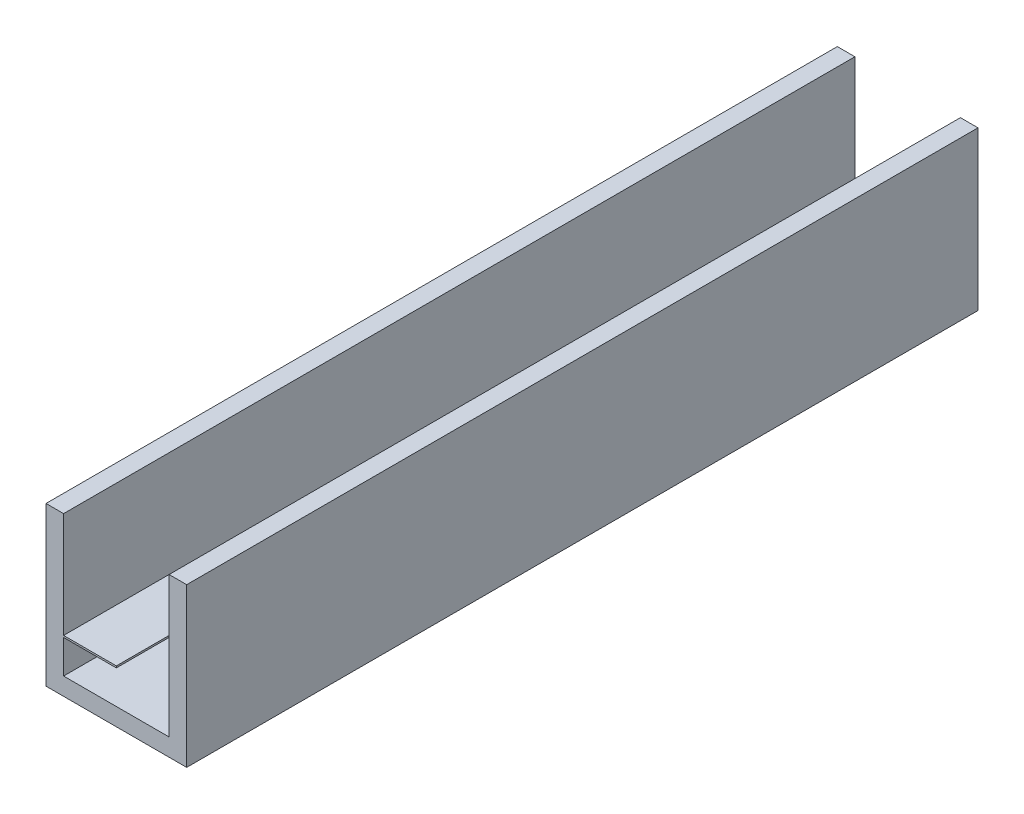
ISO-10303-21;
HEADER;
FILE_DESCRIPTION(('STEP AP214'),'2;1');
FILE_NAME('part.step','',(''),(''),'','','');
FILE_SCHEMA(('AUTOMOTIVE_DESIGN { 1 0 10303 214 1 1 1 1 }'));
ENDSEC;
DATA;
#1=APPLICATION_CONTEXT('core data for automotive mechanical design processes');
#2=APPLICATION_PROTOCOL_DEFINITION('international standard','automotive_design',2000,#1);
#3=PRODUCT_CONTEXT('',#1,'mechanical');
#4=PRODUCT('Part','Part','',(#3));
#5=PRODUCT_RELATED_PRODUCT_CATEGORY('part','',(#4));
#6=PRODUCT_DEFINITION_FORMATION('','',#4);
#7=PRODUCT_DEFINITION_CONTEXT('part definition',#1,'design');
#8=PRODUCT_DEFINITION('design','',#6,#7);
#9=PRODUCT_DEFINITION_SHAPE('','',#8);
#10=(LENGTH_UNIT() NAMED_UNIT(*) SI_UNIT(.MILLI.,.METRE.));
#11=(NAMED_UNIT(*) PLANE_ANGLE_UNIT() SI_UNIT($,.RADIAN.));
#12=(NAMED_UNIT(*) SI_UNIT($,.STERADIAN.) SOLID_ANGLE_UNIT());
#13=UNCERTAINTY_MEASURE_WITH_UNIT(LENGTH_MEASURE(1.E-05),#10,'distance_accuracy_value','');
#14=(GEOMETRIC_REPRESENTATION_CONTEXT(3) GLOBAL_UNCERTAINTY_ASSIGNED_CONTEXT((#13)) GLOBAL_UNIT_ASSIGNED_CONTEXT((#10,
#11,#12)) REPRESENTATION_CONTEXT('',''));
#15=CARTESIAN_POINT('',(0.,0.,0.));
#16=DIRECTION('',(0.,0.,1.));
#17=DIRECTION('',(1.,0.,0.));
#18=AXIS2_PLACEMENT_3D('',#15,#16,#17);
#19=CARTESIAN_POINT('',(-700.,99.9999999999999,4500.));
#20=DIRECTION('',(-1.,0.,0.));
#21=DIRECTION('',(0.,0.,1.));
#22=AXIS2_PLACEMENT_3D('',#19,#20,#21);
#23=PLANE('',#22);
#24=DIRECTION('',(0.,1.,0.));
#25=VECTOR('',#24,1.);
#26=CARTESIAN_POINT('',(-700.,99.9999999999999,0.));
#27=LINE('',#26,#25);
#28=CARTESIAN_POINT('',(-700.,99.9999999999999,0.));
#29=VERTEX_POINT('',#28);
#30=CARTESIAN_POINT('',(-700.,290.,0.));
#31=VERTEX_POINT('',#30);
#32=EDGE_CURVE('E134',#29,#31,#27,.T.);
#33=ORIENTED_EDGE('',*,*,#32,.T.);
#34=DIRECTION('',(0.,0.,-1.));
#35=VECTOR('',#34,1.);
#36=CARTESIAN_POINT('',(-700.,290.,4800.16662039607));
#37=LINE('',#36,#35);
#38=CARTESIAN_POINT('',(-700.,290.,4500.));
#39=VERTEX_POINT('',#38);
#40=EDGE_CURVE('E57',#39,#31,#37,.T.);
#41=ORIENTED_EDGE('',*,*,#40,.F.);
#42=DIRECTION('',(0.,1.,0.));
#43=VECTOR('',#42,1.);
#44=CARTESIAN_POINT('',(-700.,99.9999999999999,4500.));
#45=LINE('',#44,#43);
#46=CARTESIAN_POINT('',(-700.,99.9999999999999,4500.));
#47=VERTEX_POINT('',#46);
#48=EDGE_CURVE('E175',#47,#39,#45,.T.);
#49=ORIENTED_EDGE('',*,*,#48,.F.);
#50=DIRECTION('',(0.,0.,-1.));
#51=VECTOR('',#50,1.);
#52=CARTESIAN_POINT('',(-700.,99.9999999999999,4500.));
#53=LINE('',#52,#51);
#54=EDGE_CURVE('E205',#47,#29,#53,.T.);
#55=ORIENTED_EDGE('',*,*,#54,.T.);
#56=EDGE_LOOP('',(#33,#41,#49,#55));
#57=FACE_BOUND('',#56,.T.);
#58=ADVANCED_FACE('F34',(#57),#23,.F.);
#59=CARTESIAN_POINT('',(0.,0.,4500.));
#60=DIRECTION('',(-1.,0.,0.));
#61=DIRECTION('',(0.,0.,1.));
#62=AXIS2_PLACEMENT_3D('',#59,#60,#61);
#63=PLANE('',#62);
#64=DIRECTION('',(0.,1.,0.));
#65=VECTOR('',#64,1.);
#66=CARTESIAN_POINT('',(0.,0.,0.));
#67=LINE('',#66,#65);
#68=CARTESIAN_POINT('',(0.,0.,0.));
#69=VERTEX_POINT('',#68);
#70=CARTESIAN_POINT('',(0.,900.,0.));
#71=VERTEX_POINT('',#70);
#72=EDGE_CURVE('E164',#69,#71,#67,.T.);
#73=ORIENTED_EDGE('',*,*,#72,.T.);
#74=DIRECTION('',(0.,0.,-1.));
#75=VECTOR('',#74,1.);
#76=CARTESIAN_POINT('',(0.,900.,4500.));
#77=LINE('',#76,#75);
#78=CARTESIAN_POINT('',(0.,900.,4500.));
#79=VERTEX_POINT('',#78);
#80=EDGE_CURVE('E11',#79,#71,#77,.T.);
#81=ORIENTED_EDGE('',*,*,#80,.F.);
#82=DIRECTION('',(0.,1.,0.));
#83=VECTOR('',#82,1.);
#84=CARTESIAN_POINT('',(0.,0.,4500.));
#85=LINE('',#84,#83);
#86=CARTESIAN_POINT('',(0.,0.,4500.));
#87=VERTEX_POINT('',#86);
#88=EDGE_CURVE('E165',#87,#79,#85,.T.);
#89=ORIENTED_EDGE('',*,*,#88,.F.);
#90=DIRECTION('',(0.,0.,-1.));
#91=VECTOR('',#90,1.);
#92=CARTESIAN_POINT('',(0.,0.,4500.));
#93=LINE('',#92,#91);
#94=EDGE_CURVE('E183',#87,#69,#93,.T.);
#95=ORIENTED_EDGE('',*,*,#94,.T.);
#96=EDGE_LOOP('',(#73,#81,#89,#95));
#97=FACE_BOUND('',#96,.T.);
#98=ADVANCED_FACE('F36',(#97),#63,.F.);
#99=CARTESIAN_POINT('',(-100.,900.,4500.));
#100=DIRECTION('',(0.,-1.,0.));
#101=DIRECTION('',(1.,0.,0.));
#102=AXIS2_PLACEMENT_3D('',#99,#100,#101);
#103=PLANE('',#102);
#104=DIRECTION('',(-1.,0.,0.));
#105=VECTOR('',#104,1.);
#106=CARTESIAN_POINT('',(-100.,900.,0.));
#107=LINE('',#106,#105);
#108=CARTESIAN_POINT('',(-100.,900.,0.));
#109=VERTEX_POINT('',#108);
#110=EDGE_CURVE('E186',#71,#109,#107,.T.);
#111=ORIENTED_EDGE('',*,*,#110,.T.);
#112=DIRECTION('',(0.,0.,-1.));
#113=VECTOR('',#112,1.);
#114=CARTESIAN_POINT('',(-100.,900.,4500.));
#115=LINE('',#114,#113);
#116=CARTESIAN_POINT('',(-100.,900.,4500.));
#117=VERTEX_POINT('',#116);
#118=EDGE_CURVE('E42',#117,#109,#115,.T.);
#119=ORIENTED_EDGE('',*,*,#118,.F.);
#120=DIRECTION('',(-1.,0.,0.));
#121=VECTOR('',#120,1.);
#122=CARTESIAN_POINT('',(-100.,900.,4500.));
#123=LINE('',#122,#121);
#124=EDGE_CURVE('E168',#79,#117,#123,.T.);
#125=ORIENTED_EDGE('',*,*,#124,.F.);
#126=ORIENTED_EDGE('',*,*,#80,.T.);
#127=EDGE_LOOP('',(#111,#119,#125,#126));
#128=FACE_BOUND('',#127,.T.);
#129=ADVANCED_FACE('F247',(#128),#103,.F.);
#130=CARTESIAN_POINT('',(-100.,99.9999999999999,4500.));
#131=DIRECTION('',(1.,0.,0.));
#132=DIRECTION('',(0.,1.,0.));
#133=AXIS2_PLACEMENT_3D('',#130,#131,#132);
#134=PLANE('',#133);
#135=DIRECTION('',(0.,-1.,0.));
#136=VECTOR('',#135,1.);
#137=CARTESIAN_POINT('',(-100.,99.9999999999999,0.));
#138=LINE('',#137,#136);
#139=CARTESIAN_POINT('',(-100.,99.9999999999999,0.));
#140=VERTEX_POINT('',#139);
#141=EDGE_CURVE('E188',#109,#140,#138,.T.);
#142=ORIENTED_EDGE('',*,*,#141,.T.);
#143=DIRECTION('',(0.,0.,-1.));
#144=VECTOR('',#143,1.);
#145=CARTESIAN_POINT('',(-100.,99.9999999999999,4500.));
#146=LINE('',#145,#144);
#147=CARTESIAN_POINT('',(-100.,99.9999999999999,4500.));
#148=VERTEX_POINT('',#147);
#149=EDGE_CURVE('E208',#148,#140,#146,.T.);
#150=ORIENTED_EDGE('',*,*,#149,.F.);
#151=DIRECTION('',(0.,-1.,0.));
#152=VECTOR('',#151,1.);
#153=CARTESIAN_POINT('',(-100.,99.9999999999999,4500.));
#154=LINE('',#153,#152);
#155=EDGE_CURVE('E171',#117,#148,#154,.T.);
#156=ORIENTED_EDGE('',*,*,#155,.F.);
#157=ORIENTED_EDGE('',*,*,#118,.T.);
#158=EDGE_LOOP('',(#142,#150,#156,#157));
#159=FACE_BOUND('',#158,.T.);
#160=ADVANCED_FACE('F215',(#159),#134,.F.);
#161=CARTESIAN_POINT('',(-700.,99.9999999999999,4500.));
#162=DIRECTION('',(0.,-1.,0.));
#163=DIRECTION('',(0.,0.,-1.));
#164=AXIS2_PLACEMENT_3D('',#161,#162,#163);
#165=PLANE('',#164);
#166=DIRECTION('',(-1.,0.,0.));
#167=VECTOR('',#166,1.);
#168=CARTESIAN_POINT('',(-700.,99.9999999999999,0.));
#169=LINE('',#168,#167);
#170=EDGE_CURVE('E135',#140,#29,#169,.T.);
#171=ORIENTED_EDGE('',*,*,#170,.T.);
#172=ORIENTED_EDGE('',*,*,#54,.F.);
#173=DIRECTION('',(-1.,0.,0.));
#174=VECTOR('',#173,1.);
#175=CARTESIAN_POINT('',(-700.,99.9999999999999,4500.));
#176=LINE('',#175,#174);
#177=EDGE_CURVE('E173',#148,#47,#176,.T.);
#178=ORIENTED_EDGE('',*,*,#177,.F.);
#179=ORIENTED_EDGE('',*,*,#149,.T.);
#180=EDGE_LOOP('',(#171,#172,#178,#179));
#181=FACE_BOUND('',#180,.T.);
#182=ADVANCED_FACE('F222',(#181),#165,.F.);
#183=CARTESIAN_POINT('',(-700.,300.,4500.));
#184=VERTEX_POINT('',#183);
#185=CARTESIAN_POINT('',(-700.,900.,4500.));
#186=VERTEX_POINT('',#185);
#187=EDGE_CURVE('E49',#184,#186,#45,.T.);
#188=ORIENTED_EDGE('',*,*,#187,.F.);
#189=DIRECTION('',(0.,0.,-1.));
#190=VECTOR('',#189,1.);
#191=CARTESIAN_POINT('',(-700.,300.,4800.16662039607));
#192=LINE('',#191,#190);
#193=CARTESIAN_POINT('',(-700.,300.,0.));
#194=VERTEX_POINT('',#193);
#195=EDGE_CURVE('E138',#184,#194,#192,.T.);
#196=ORIENTED_EDGE('',*,*,#195,.T.);
#197=CARTESIAN_POINT('',(-700.,900.,0.));
#198=VERTEX_POINT('',#197);
#199=EDGE_CURVE('E125',#194,#198,#27,.T.);
#200=ORIENTED_EDGE('',*,*,#199,.T.);
#201=DIRECTION('',(0.,0.,-1.));
#202=VECTOR('',#201,1.);
#203=CARTESIAN_POINT('',(-700.,900.,4500.));
#204=LINE('',#203,#202);
#205=EDGE_CURVE('E203',#186,#198,#204,.T.);
#206=ORIENTED_EDGE('',*,*,#205,.F.);
#207=EDGE_LOOP('',(#188,#196,#200,#206));
#208=FACE_BOUND('',#207,.T.);
#209=ADVANCED_FACE('F139',(#208),#23,.F.);
#210=CARTESIAN_POINT('',(-700.,900.,4500.));
#211=DIRECTION('',(0.,-1.,0.));
#212=DIRECTION('',(0.,0.,-1.));
#213=AXIS2_PLACEMENT_3D('',#210,#211,#212);
#214=PLANE('',#213);
#215=DIRECTION('',(-1.,0.,0.));
#216=VECTOR('',#215,1.);
#217=CARTESIAN_POINT('',(-700.,900.,0.));
#218=LINE('',#217,#216);
#219=CARTESIAN_POINT('',(-800.,900.,0.));
#220=VERTEX_POINT('',#219);
#221=EDGE_CURVE('E132',#198,#220,#218,.T.);
#222=ORIENTED_EDGE('',*,*,#221,.T.);
#223=DIRECTION('',(0.,0.,-1.));
#224=VECTOR('',#223,1.);
#225=CARTESIAN_POINT('',(-800.,900.,4500.));
#226=LINE('',#225,#224);
#227=CARTESIAN_POINT('',(-800.,900.,4500.));
#228=VERTEX_POINT('',#227);
#229=EDGE_CURVE('E200',#228,#220,#226,.T.);
#230=ORIENTED_EDGE('',*,*,#229,.F.);
#231=DIRECTION('',(-1.,0.,0.));
#232=VECTOR('',#231,1.);
#233=CARTESIAN_POINT('',(-700.,900.,4500.));
#234=LINE('',#233,#232);
#235=EDGE_CURVE('E177',#186,#228,#234,.T.);
#236=ORIENTED_EDGE('',*,*,#235,.F.);
#237=ORIENTED_EDGE('',*,*,#205,.T.);
#238=EDGE_LOOP('',(#222,#230,#236,#237));
#239=FACE_BOUND('',#238,.T.);
#240=ADVANCED_FACE('F252',(#239),#214,.F.);
#241=CARTESIAN_POINT('',(-800.,0.,4500.));
#242=DIRECTION('',(1.,0.,0.));
#243=DIRECTION('',(0.,0.,-1.));
#244=AXIS2_PLACEMENT_3D('',#241,#242,#243);
#245=PLANE('',#244);
#246=DIRECTION('',(0.,-1.,0.));
#247=VECTOR('',#246,1.);
#248=CARTESIAN_POINT('',(-800.,0.,0.));
#249=LINE('',#248,#247);
#250=CARTESIAN_POINT('',(-800.,0.,0.));
#251=VERTEX_POINT('',#250);
#252=EDGE_CURVE('E192',#220,#251,#249,.T.);
#253=ORIENTED_EDGE('',*,*,#252,.T.);
#254=DIRECTION('',(0.,0.,-1.));
#255=VECTOR('',#254,1.);
#256=CARTESIAN_POINT('',(-800.,0.,4500.));
#257=LINE('',#256,#255);
#258=CARTESIAN_POINT('',(-800.,0.,4500.));
#259=VERTEX_POINT('',#258);
#260=EDGE_CURVE('E197',#259,#251,#257,.T.);
#261=ORIENTED_EDGE('',*,*,#260,.F.);
#262=DIRECTION('',(0.,-1.,0.));
#263=VECTOR('',#262,1.);
#264=CARTESIAN_POINT('',(-800.,0.,4500.));
#265=LINE('',#264,#263);
#266=EDGE_CURVE('E179',#228,#259,#265,.T.);
#267=ORIENTED_EDGE('',*,*,#266,.F.);
#268=ORIENTED_EDGE('',*,*,#229,.T.);
#269=EDGE_LOOP('',(#253,#261,#267,#268));
#270=FACE_BOUND('',#269,.T.);
#271=ADVANCED_FACE('F257',(#270),#245,.F.);
#272=CARTESIAN_POINT('',(0.,0.,4500.));
#273=DIRECTION('',(0.,1.,0.));
#274=DIRECTION('',(0.,0.,1.));
#275=AXIS2_PLACEMENT_3D('',#272,#273,#274);
#276=PLANE('',#275);
#277=DIRECTION('',(1.,0.,0.));
#278=VECTOR('',#277,1.);
#279=CARTESIAN_POINT('',(0.,0.,0.));
#280=LINE('',#279,#278);
#281=EDGE_CURVE('E169',#251,#69,#280,.T.);
#282=ORIENTED_EDGE('',*,*,#281,.T.);
#283=ORIENTED_EDGE('',*,*,#94,.F.);
#284=DIRECTION('',(1.,0.,0.));
#285=VECTOR('',#284,1.);
#286=CARTESIAN_POINT('',(0.,0.,4500.));
#287=LINE('',#286,#285);
#288=EDGE_CURVE('E181',#259,#87,#287,.T.);
#289=ORIENTED_EDGE('',*,*,#288,.F.);
#290=ORIENTED_EDGE('',*,*,#260,.T.);
#291=EDGE_LOOP('',(#282,#283,#289,#290));
#292=FACE_BOUND('',#291,.T.);
#293=ADVANCED_FACE('F271',(#292),#276,.F.);
#294=CARTESIAN_POINT('',(0.,0.,4500.));
#295=DIRECTION('',(0.,0.,-1.));
#296=DIRECTION('',(-1.,0.,0.));
#297=AXIS2_PLACEMENT_3D('',#294,#295,#296);
#298=PLANE('',#297);
#299=ORIENTED_EDGE('',*,*,#88,.T.);
#300=ORIENTED_EDGE('',*,*,#124,.T.);
#301=ORIENTED_EDGE('',*,*,#155,.T.);
#302=ORIENTED_EDGE('',*,*,#177,.T.);
#303=ORIENTED_EDGE('',*,*,#48,.T.);
#304=DIRECTION('',(1.,0.,0.));
#305=VECTOR('',#304,1.);
#306=CARTESIAN_POINT('',(-700.,290.,4500.));
#307=LINE('',#306,#305);
#308=CARTESIAN_POINT('',(-400.,290.,4500.));
#309=VERTEX_POINT('',#308);
#310=EDGE_CURVE('E152',#39,#309,#307,.T.);
#311=ORIENTED_EDGE('',*,*,#310,.T.);
#312=DIRECTION('',(0.,1.,0.));
#313=VECTOR('',#312,1.);
#314=CARTESIAN_POINT('',(-400.,290.,4500.));
#315=LINE('',#314,#313);
#316=CARTESIAN_POINT('',(-400.,300.,4500.));
#317=VERTEX_POINT('',#316);
#318=EDGE_CURVE('E158',#309,#317,#315,.T.);
#319=ORIENTED_EDGE('',*,*,#318,.T.);
#320=DIRECTION('',(-1.,0.,0.));
#321=VECTOR('',#320,1.);
#322=CARTESIAN_POINT('',(-400.,300.,4500.));
#323=LINE('',#322,#321);
#324=EDGE_CURVE('E162',#317,#184,#323,.T.);
#325=ORIENTED_EDGE('',*,*,#324,.T.);
#326=ORIENTED_EDGE('',*,*,#187,.T.);
#327=ORIENTED_EDGE('',*,*,#235,.T.);
#328=ORIENTED_EDGE('',*,*,#266,.T.);
#329=ORIENTED_EDGE('',*,*,#288,.T.);
#330=EDGE_LOOP('',(#299,#300,#301,#302,#303,#311,#319,#325,#326,#327,#328,#329));
#331=FACE_BOUND('',#330,.T.);
#332=ADVANCED_FACE('F226',(#331),#298,.F.);
#333=CARTESIAN_POINT('',(0.,0.,0.));
#334=DIRECTION('',(0.,0.,-1.));
#335=DIRECTION('',(-1.,0.,0.));
#336=AXIS2_PLACEMENT_3D('',#333,#334,#335);
#337=PLANE('',#336);
#338=ORIENTED_EDGE('',*,*,#72,.F.);
#339=ORIENTED_EDGE('',*,*,#281,.F.);
#340=ORIENTED_EDGE('',*,*,#252,.F.);
#341=ORIENTED_EDGE('',*,*,#221,.F.);
#342=ORIENTED_EDGE('',*,*,#199,.F.);
#343=DIRECTION('',(1.,0.,0.));
#344=VECTOR('',#343,1.);
#345=CARTESIAN_POINT('',(-400.,300.,0.));
#346=LINE('',#345,#344);
#347=CARTESIAN_POINT('',(-400.,300.,0.));
#348=VERTEX_POINT('',#347);
#349=EDGE_CURVE('E130',#194,#348,#346,.T.);
#350=ORIENTED_EDGE('',*,*,#349,.T.);
#351=DIRECTION('',(0.,-1.,0.));
#352=VECTOR('',#351,1.);
#353=CARTESIAN_POINT('',(-400.,290.,0.));
#354=LINE('',#353,#352);
#355=CARTESIAN_POINT('',(-400.,290.,0.));
#356=VERTEX_POINT('',#355);
#357=EDGE_CURVE('E148',#348,#356,#354,.T.);
#358=ORIENTED_EDGE('',*,*,#357,.T.);
#359=DIRECTION('',(-1.,0.,0.));
#360=VECTOR('',#359,1.);
#361=CARTESIAN_POINT('',(-700.,290.,0.));
#362=LINE('',#361,#360);
#363=EDGE_CURVE('E143',#356,#31,#362,.T.);
#364=ORIENTED_EDGE('',*,*,#363,.T.);
#365=ORIENTED_EDGE('',*,*,#32,.F.);
#366=ORIENTED_EDGE('',*,*,#170,.F.);
#367=ORIENTED_EDGE('',*,*,#141,.F.);
#368=ORIENTED_EDGE('',*,*,#110,.F.);
#369=EDGE_LOOP('',(#338,#339,#340,#341,#342,#350,#358,#364,#365,#366,#367,#368));
#370=FACE_BOUND('',#369,.T.);
#371=ADVANCED_FACE('F127',(#370),#337,.T.);
#372=CARTESIAN_POINT('',(-700.,290.,4800.16662039607));
#373=DIRECTION('',(0.,-1.,0.));
#374=DIRECTION('',(1.,0.,0.));
#375=AXIS2_PLACEMENT_3D('',#372,#373,#374);
#376=PLANE('',#375);
#377=ORIENTED_EDGE('',*,*,#310,.F.);
#378=ORIENTED_EDGE('',*,*,#40,.T.);
#379=ORIENTED_EDGE('',*,*,#363,.F.);
#380=DIRECTION('',(0.,0.,-1.));
#381=VECTOR('',#380,1.);
#382=CARTESIAN_POINT('',(-400.,290.,4800.16662039607));
#383=LINE('',#382,#381);
#384=EDGE_CURVE('E159',#309,#356,#383,.T.);
#385=ORIENTED_EDGE('',*,*,#384,.F.);
#386=EDGE_LOOP('',(#377,#378,#379,#385));
#387=FACE_BOUND('',#386,.T.);
#388=ADVANCED_FACE('F230',(#387),#376,.T.);
#389=CARTESIAN_POINT('',(-400.,290.,4800.16662039607));
#390=DIRECTION('',(1.,0.,0.));
#391=DIRECTION('',(0.,0.,-1.));
#392=AXIS2_PLACEMENT_3D('',#389,#390,#391);
#393=PLANE('',#392);
#394=ORIENTED_EDGE('',*,*,#318,.F.);
#395=ORIENTED_EDGE('',*,*,#384,.T.);
#396=ORIENTED_EDGE('',*,*,#357,.F.);
#397=DIRECTION('',(0.,0.,-1.));
#398=VECTOR('',#397,1.);
#399=CARTESIAN_POINT('',(-400.,300.,4800.16662039607));
#400=LINE('',#399,#398);
#401=EDGE_CURVE('E142',#317,#348,#400,.T.);
#402=ORIENTED_EDGE('',*,*,#401,.F.);
#403=EDGE_LOOP('',(#394,#395,#396,#402));
#404=FACE_BOUND('',#403,.T.);
#405=ADVANCED_FACE('F233',(#404),#393,.T.);
#406=CARTESIAN_POINT('',(-400.,300.,4800.16662039607));
#407=DIRECTION('',(0.,1.,0.));
#408=DIRECTION('',(0.,0.,1.));
#409=AXIS2_PLACEMENT_3D('',#406,#407,#408);
#410=PLANE('',#409);
#411=ORIENTED_EDGE('',*,*,#324,.F.);
#412=ORIENTED_EDGE('',*,*,#401,.T.);
#413=ORIENTED_EDGE('',*,*,#349,.F.);
#414=ORIENTED_EDGE('',*,*,#195,.F.);
#415=EDGE_LOOP('',(#411,#412,#413,#414));
#416=FACE_BOUND('',#415,.T.);
#417=ADVANCED_FACE('F145',(#416),#410,.T.);
#418=CLOSED_SHELL('',(#58,#98,#129,#160,#182,#209,#240,#271,#293,#332,#371,#388,#405,#417));
#419=MANIFOLD_SOLID_BREP('B2',#418);
#420=ADVANCED_BREP_SHAPE_REPRESENTATION('',(#18,#419),#14);
#421=SHAPE_DEFINITION_REPRESENTATION(#9,#420);
ENDSEC;
END-ISO-10303-21;
